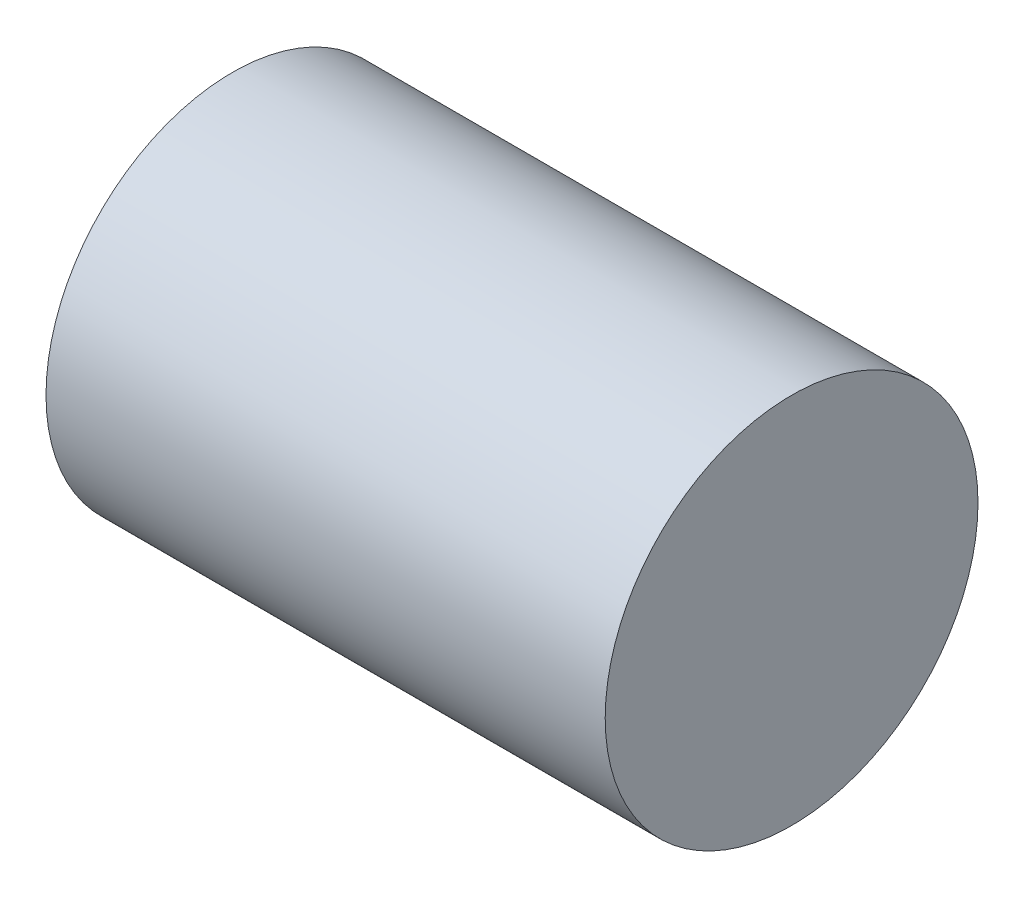
ISO-10303-21;
HEADER;
FILE_DESCRIPTION(('STEP AP214'),'2;1');
FILE_NAME('part.step','',(''),(''),'','','');
FILE_SCHEMA(('AUTOMOTIVE_DESIGN { 1 0 10303 214 1 1 1 1 }'));
ENDSEC;
DATA;
#1=APPLICATION_CONTEXT('core data for automotive mechanical design processes');
#2=APPLICATION_PROTOCOL_DEFINITION('international standard','automotive_design',2000,#1);
#3=PRODUCT_CONTEXT('',#1,'mechanical');
#4=PRODUCT('Part','Part','',(#3));
#5=PRODUCT_RELATED_PRODUCT_CATEGORY('part','',(#4));
#6=PRODUCT_DEFINITION_FORMATION('','',#4);
#7=PRODUCT_DEFINITION_CONTEXT('part definition',#1,'design');
#8=PRODUCT_DEFINITION('design','',#6,#7);
#9=PRODUCT_DEFINITION_SHAPE('','',#8);
#10=(LENGTH_UNIT() NAMED_UNIT(*) SI_UNIT(.MILLI.,.METRE.));
#11=(NAMED_UNIT(*) PLANE_ANGLE_UNIT() SI_UNIT($,.RADIAN.));
#12=(NAMED_UNIT(*) SI_UNIT($,.STERADIAN.) SOLID_ANGLE_UNIT());
#13=UNCERTAINTY_MEASURE_WITH_UNIT(LENGTH_MEASURE(1.E-05),#10,'distance_accuracy_value','');
#14=(GEOMETRIC_REPRESENTATION_CONTEXT(3) GLOBAL_UNCERTAINTY_ASSIGNED_CONTEXT((#13)) GLOBAL_UNIT_ASSIGNED_CONTEXT((#10,
#11,#12)) REPRESENTATION_CONTEXT('',''));
#15=CARTESIAN_POINT('',(0.,0.,0.));
#16=DIRECTION('',(0.,0.,1.));
#17=DIRECTION('',(1.,0.,0.));
#18=AXIS2_PLACEMENT_3D('',#15,#16,#17);
#19=CARTESIAN_POINT('',(3.,0.,0.));
#20=DIRECTION('',(-1.,0.,0.));
#21=DIRECTION('',(0.,0.,1.));
#22=AXIS2_PLACEMENT_3D('',#19,#20,#21);
#23=CYLINDRICAL_SURFACE('',#22,2.);
#24=CARTESIAN_POINT('',(3.,0.,0.));
#25=DIRECTION('',(1.,0.,0.));
#26=DIRECTION('',(0.,0.,-1.));
#27=AXIS2_PLACEMENT_3D('',#24,#25,#26);
#28=CIRCLE('',#27,2.);
#29=CARTESIAN_POINT('',(3.,0.,-2.));
#30=VERTEX_POINT('',#29);
#31=EDGE_CURVE('E10',#30,#30,#28,.T.);
#32=ORIENTED_EDGE('',*,*,#31,.F.);
#33=EDGE_LOOP('',(#32));
#34=FACE_BOUND('',#33,.T.);
#35=CARTESIAN_POINT('',(-3.,0.,0.));
#36=DIRECTION('',(1.,0.,0.));
#37=DIRECTION('',(0.,0.,-1.));
#38=AXIS2_PLACEMENT_3D('',#35,#36,#37);
#39=CIRCLE('',#38,2.);
#40=CARTESIAN_POINT('',(-3.,0.,-2.));
#41=VERTEX_POINT('',#40);
#42=EDGE_CURVE('E34',#41,#41,#39,.T.);
#43=ORIENTED_EDGE('',*,*,#42,.T.);
#44=EDGE_LOOP('',(#43));
#45=FACE_BOUND('',#44,.T.);
#46=ADVANCED_FACE('F31',(#34,#45),#23,.T.);
#47=CARTESIAN_POINT('',(3.,0.,0.));
#48=DIRECTION('',(1.,0.,0.));
#49=DIRECTION('',(0.,0.,-1.));
#50=AXIS2_PLACEMENT_3D('',#47,#48,#49);
#51=PLANE('',#50);
#52=ORIENTED_EDGE('',*,*,#31,.T.);
#53=EDGE_LOOP('',(#52));
#54=FACE_BOUND('',#53,.T.);
#55=ADVANCED_FACE('F46',(#54),#51,.T.);
#56=CARTESIAN_POINT('',(-3.,0.,0.));
#57=DIRECTION('',(1.,0.,0.));
#58=DIRECTION('',(0.,0.,-1.));
#59=AXIS2_PLACEMENT_3D('',#56,#57,#58);
#60=PLANE('',#59);
#61=ORIENTED_EDGE('',*,*,#42,.F.);
#62=EDGE_LOOP('',(#61));
#63=FACE_BOUND('',#62,.T.);
#64=ADVANCED_FACE('F44',(#63),#60,.F.);
#65=CLOSED_SHELL('',(#46,#55,#64));
#66=MANIFOLD_SOLID_BREP('B2',#65);
#67=ADVANCED_BREP_SHAPE_REPRESENTATION('',(#18,#66),#14);
#68=SHAPE_DEFINITION_REPRESENTATION(#9,#67);
ENDSEC;
END-ISO-10303-21;
